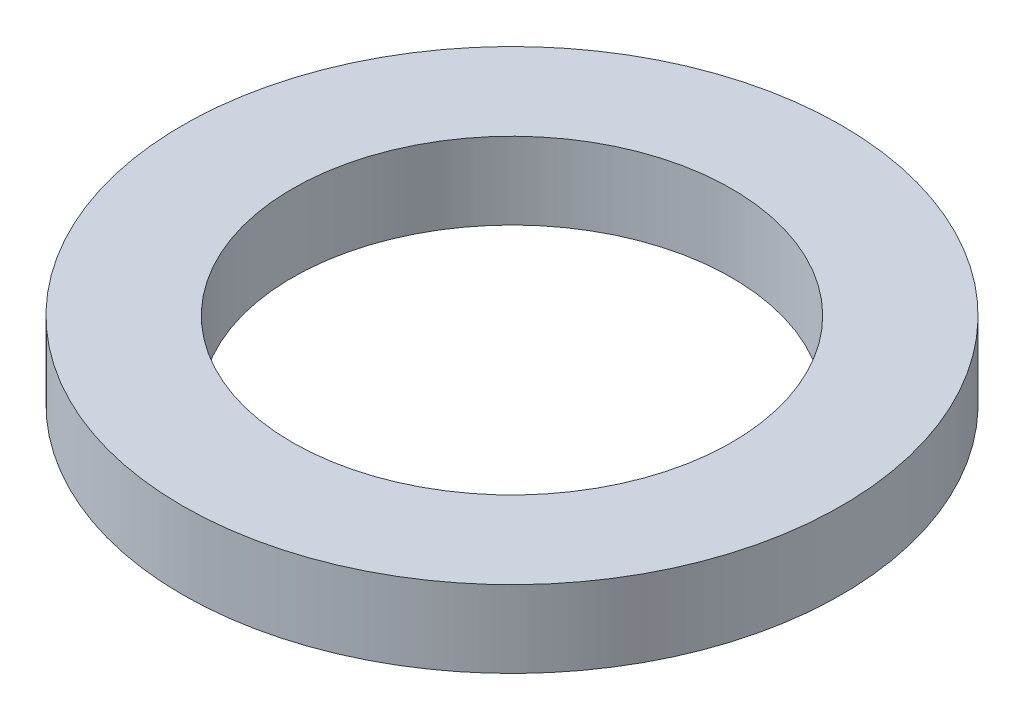
ISO-10303-21;
HEADER;
FILE_DESCRIPTION(('STEP AP214'),'2;1');
FILE_NAME('part.step','',(''),(''),'','','');
FILE_SCHEMA(('AUTOMOTIVE_DESIGN { 1 0 10303 214 1 1 1 1 }'));
ENDSEC;
DATA;
#1=APPLICATION_CONTEXT('core data for automotive mechanical design processes');
#2=APPLICATION_PROTOCOL_DEFINITION('international standard','automotive_design',2000,#1);
#3=PRODUCT_CONTEXT('',#1,'mechanical');
#4=PRODUCT('Part','Part','',(#3));
#5=PRODUCT_RELATED_PRODUCT_CATEGORY('part','',(#4));
#6=PRODUCT_DEFINITION_FORMATION('','',#4);
#7=PRODUCT_DEFINITION_CONTEXT('part definition',#1,'design');
#8=PRODUCT_DEFINITION('design','',#6,#7);
#9=PRODUCT_DEFINITION_SHAPE('','',#8);
#10=(LENGTH_UNIT() NAMED_UNIT(*) SI_UNIT(.MILLI.,.METRE.));
#11=(NAMED_UNIT(*) PLANE_ANGLE_UNIT() SI_UNIT($,.RADIAN.));
#12=(NAMED_UNIT(*) SI_UNIT($,.STERADIAN.) SOLID_ANGLE_UNIT());
#13=UNCERTAINTY_MEASURE_WITH_UNIT(LENGTH_MEASURE(1.E-05),#10,'distance_accuracy_value','');
#14=(GEOMETRIC_REPRESENTATION_CONTEXT(3) GLOBAL_UNCERTAINTY_ASSIGNED_CONTEXT((#13)) GLOBAL_UNIT_ASSIGNED_CONTEXT((#10,
#11,#12)) REPRESENTATION_CONTEXT('',''));
#15=CARTESIAN_POINT('',(0.,0.,0.));
#16=DIRECTION('',(0.,0.,1.));
#17=DIRECTION('',(1.,0.,0.));
#18=AXIS2_PLACEMENT_3D('',#15,#16,#17);
#19=CARTESIAN_POINT('',(0.,7.,0.));
#20=DIRECTION('',(0.,-1.,0.));
#21=DIRECTION('',(0.,0.,-1.));
#22=AXIS2_PLACEMENT_3D('',#19,#20,#21);
#23=CYLINDRICAL_SURFACE('',#22,30.);
#24=CARTESIAN_POINT('',(0.,7.,0.));
#25=DIRECTION('',(0.,1.,0.));
#26=DIRECTION('',(0.,0.,1.));
#27=AXIS2_PLACEMENT_3D('',#24,#25,#26);
#28=CIRCLE('',#27,30.);
#29=CARTESIAN_POINT('',(0.,7.,30.));
#30=VERTEX_POINT('',#29);
#31=EDGE_CURVE('E10',#30,#30,#28,.T.);
#32=ORIENTED_EDGE('',*,*,#31,.F.);
#33=EDGE_LOOP('',(#32));
#34=FACE_BOUND('',#33,.T.);
#35=CARTESIAN_POINT('',(0.,0.,0.));
#36=DIRECTION('',(0.,1.,0.));
#37=DIRECTION('',(0.,0.,1.));
#38=AXIS2_PLACEMENT_3D('',#35,#36,#37);
#39=CIRCLE('',#38,30.);
#40=CARTESIAN_POINT('',(0.,0.,30.));
#41=VERTEX_POINT('',#40);
#42=EDGE_CURVE('E37',#41,#41,#39,.T.);
#43=ORIENTED_EDGE('',*,*,#42,.T.);
#44=EDGE_LOOP('',(#43));
#45=FACE_BOUND('',#44,.T.);
#46=ADVANCED_FACE('F40',(#34,#45),#23,.T.);
#47=CARTESIAN_POINT('',(0.,7.,0.));
#48=DIRECTION('',(0.,1.,0.));
#49=DIRECTION('',(0.,0.,1.));
#50=AXIS2_PLACEMENT_3D('',#47,#48,#49);
#51=PLANE('',#50);
#52=CARTESIAN_POINT('',(0.,7.,0.));
#53=DIRECTION('',(0.,1.,0.));
#54=DIRECTION('',(0.,0.,1.));
#55=AXIS2_PLACEMENT_3D('',#52,#53,#54);
#56=CIRCLE('',#55,20.);
#57=CARTESIAN_POINT('',(0.,7.,20.));
#58=VERTEX_POINT('',#57);
#59=EDGE_CURVE('E50',#58,#58,#56,.T.);
#60=ORIENTED_EDGE('',*,*,#59,.F.);
#61=EDGE_LOOP('',(#60));
#62=FACE_BOUND('',#61,.T.);
#63=ORIENTED_EDGE('',*,*,#31,.T.);
#64=EDGE_LOOP('',(#63));
#65=FACE_BOUND('',#64,.T.);
#66=ADVANCED_FACE('F59',(#62,#65),#51,.T.);
#67=CARTESIAN_POINT('',(0.,0.,0.));
#68=DIRECTION('',(0.,1.,0.));
#69=DIRECTION('',(0.,0.,1.));
#70=AXIS2_PLACEMENT_3D('',#67,#68,#69);
#71=PLANE('',#70);
#72=CARTESIAN_POINT('',(0.,0.,0.));
#73=DIRECTION('',(0.,1.,0.));
#74=DIRECTION('',(0.,0.,1.));
#75=AXIS2_PLACEMENT_3D('',#72,#73,#74);
#76=CIRCLE('',#75,20.);
#77=CARTESIAN_POINT('',(0.,0.,20.));
#78=VERTEX_POINT('',#77);
#79=EDGE_CURVE('E47',#78,#78,#76,.T.);
#80=ORIENTED_EDGE('',*,*,#79,.T.);
#81=EDGE_LOOP('',(#80));
#82=FACE_BOUND('',#81,.T.);
#83=ORIENTED_EDGE('',*,*,#42,.F.);
#84=EDGE_LOOP('',(#83));
#85=FACE_BOUND('',#84,.T.);
#86=ADVANCED_FACE('F58',(#82,#85),#71,.F.);
#87=CARTESIAN_POINT('',(0.,7.,0.));
#88=DIRECTION('',(0.,-1.,0.));
#89=DIRECTION('',(0.,0.,-1.));
#90=AXIS2_PLACEMENT_3D('',#87,#88,#89);
#91=CYLINDRICAL_SURFACE('',#90,20.);
#92=ORIENTED_EDGE('',*,*,#59,.T.);
#93=EDGE_LOOP('',(#92));
#94=FACE_BOUND('',#93,.T.);
#95=ORIENTED_EDGE('',*,*,#79,.F.);
#96=EDGE_LOOP('',(#95));
#97=FACE_BOUND('',#96,.T.);
#98=ADVANCED_FACE('F54',(#94,#97),#91,.F.);
#99=CLOSED_SHELL('',(#46,#66,#86,#98));
#100=MANIFOLD_SOLID_BREP('B2',#99);
#101=ADVANCED_BREP_SHAPE_REPRESENTATION('',(#18,#100),#14);
#102=SHAPE_DEFINITION_REPRESENTATION(#9,#101);
ENDSEC;
END-ISO-10303-21;
